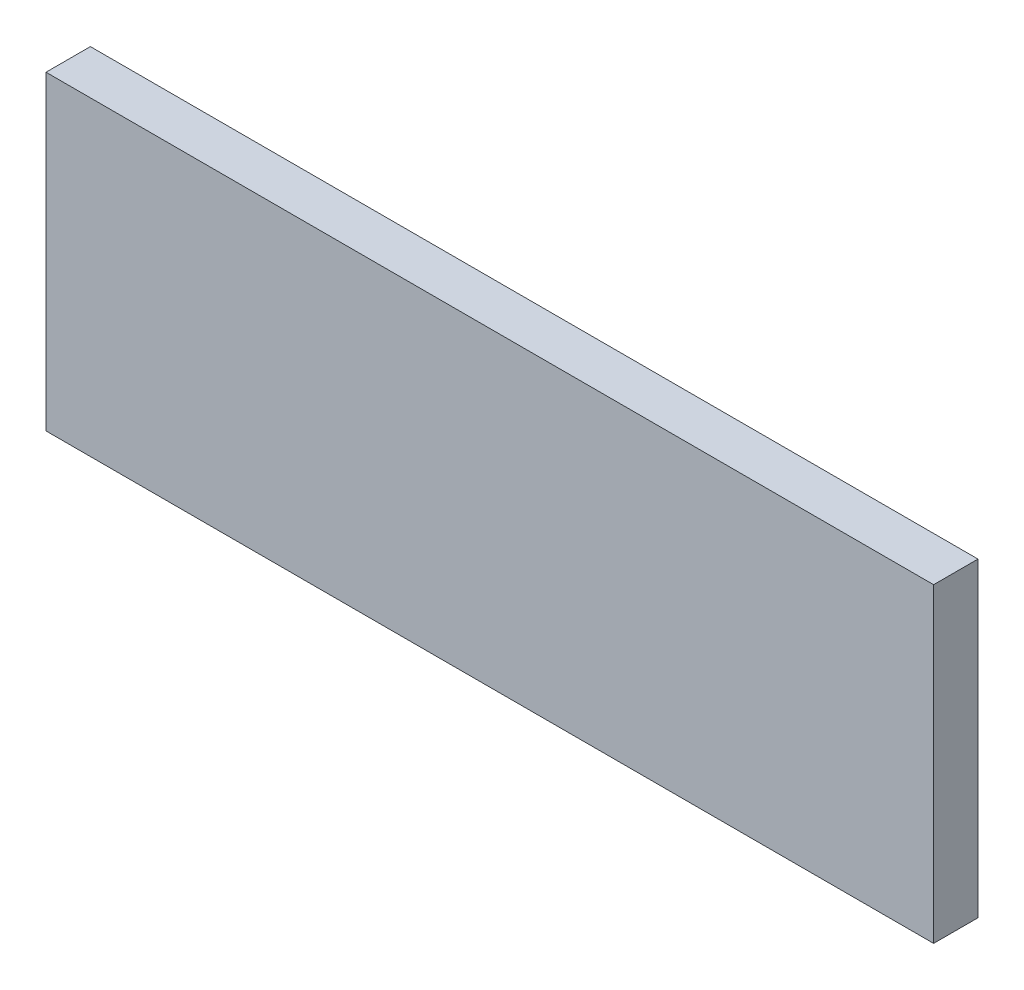
ISO-10303-21;
HEADER;
FILE_DESCRIPTION(('STEP AP214'),'2;1');
FILE_NAME('part.step','',(''),(''),'','','');
FILE_SCHEMA(('AUTOMOTIVE_DESIGN { 1 0 10303 214 1 1 1 1 }'));
ENDSEC;
DATA;
#1=APPLICATION_CONTEXT('core data for automotive mechanical design processes');
#2=APPLICATION_PROTOCOL_DEFINITION('international standard','automotive_design',2000,#1);
#3=PRODUCT_CONTEXT('',#1,'mechanical');
#4=PRODUCT('Part','Part','',(#3));
#5=PRODUCT_RELATED_PRODUCT_CATEGORY('part','',(#4));
#6=PRODUCT_DEFINITION_FORMATION('','',#4);
#7=PRODUCT_DEFINITION_CONTEXT('part definition',#1,'design');
#8=PRODUCT_DEFINITION('design','',#6,#7);
#9=PRODUCT_DEFINITION_SHAPE('','',#8);
#10=(LENGTH_UNIT() NAMED_UNIT(*) SI_UNIT(.MILLI.,.METRE.));
#11=(NAMED_UNIT(*) PLANE_ANGLE_UNIT() SI_UNIT($,.RADIAN.));
#12=(NAMED_UNIT(*) SI_UNIT($,.STERADIAN.) SOLID_ANGLE_UNIT());
#13=UNCERTAINTY_MEASURE_WITH_UNIT(LENGTH_MEASURE(1.E-05),#10,'distance_accuracy_value','');
#14=(GEOMETRIC_REPRESENTATION_CONTEXT(3) GLOBAL_UNCERTAINTY_ASSIGNED_CONTEXT((#13)) GLOBAL_UNIT_ASSIGNED_CONTEXT((#10,
#11,#12)) REPRESENTATION_CONTEXT('',''));
#15=CARTESIAN_POINT('',(0.,0.,0.));
#16=DIRECTION('',(0.,0.,1.));
#17=DIRECTION('',(1.,0.,0.));
#18=AXIS2_PLACEMENT_3D('',#15,#16,#17);
#19=CARTESIAN_POINT('',(-125.295302013423,74.2225503355704,12.7));
#20=DIRECTION('',(1.,0.,0.));
#21=DIRECTION('',(0.,0.,-1.));
#22=AXIS2_PLACEMENT_3D('',#19,#20,#21);
#23=PLANE('',#22);
#24=DIRECTION('',(0.,-1.,0.));
#25=VECTOR('',#24,1.);
#26=CARTESIAN_POINT('',(-125.295302013423,74.2225503355704,0.));
#27=LINE('',#26,#25);
#28=CARTESIAN_POINT('',(-125.295302013423,74.2225503355704,0.));
#29=VERTEX_POINT('',#28);
#30=CARTESIAN_POINT('',(-125.295302013423,-14.6774496644296,0.));
#31=VERTEX_POINT('',#30);
#32=EDGE_CURVE('E107',#29,#31,#27,.T.);
#33=ORIENTED_EDGE('',*,*,#32,.T.);
#34=DIRECTION('',(0.,0.,-1.));
#35=VECTOR('',#34,1.);
#36=CARTESIAN_POINT('',(-125.295302013423,-14.6774496644296,12.7));
#37=LINE('',#36,#35);
#38=CARTESIAN_POINT('',(-125.295302013423,-14.6774496644296,12.7));
#39=VERTEX_POINT('',#38);
#40=EDGE_CURVE('E11',#39,#31,#37,.T.);
#41=ORIENTED_EDGE('',*,*,#40,.F.);
#42=DIRECTION('',(0.,-1.,0.));
#43=VECTOR('',#42,1.);
#44=CARTESIAN_POINT('',(-125.295302013423,74.2225503355704,12.7));
#45=LINE('',#44,#43);
#46=CARTESIAN_POINT('',(-125.295302013423,74.2225503355704,12.7));
#47=VERTEX_POINT('',#46);
#48=EDGE_CURVE('E91',#47,#39,#45,.T.);
#49=ORIENTED_EDGE('',*,*,#48,.F.);
#50=DIRECTION('',(0.,0.,-1.));
#51=VECTOR('',#50,1.);
#52=CARTESIAN_POINT('',(-125.295302013423,74.2225503355704,12.7));
#53=LINE('',#52,#51);
#54=EDGE_CURVE('E103',#47,#29,#53,.T.);
#55=ORIENTED_EDGE('',*,*,#54,.T.);
#56=EDGE_LOOP('',(#33,#41,#49,#55));
#57=FACE_BOUND('',#56,.T.);
#58=ADVANCED_FACE('F39',(#57),#23,.F.);
#59=CARTESIAN_POINT('',(-125.295302013423,-14.6774496644296,12.7));
#60=DIRECTION('',(0.,1.,0.));
#61=DIRECTION('',(0.,0.,1.));
#62=AXIS2_PLACEMENT_3D('',#59,#60,#61);
#63=PLANE('',#62);
#64=DIRECTION('',(1.,0.,0.));
#65=VECTOR('',#64,1.);
#66=CARTESIAN_POINT('',(-125.295302013423,-14.6774496644296,0.));
#67=LINE('',#66,#65);
#68=CARTESIAN_POINT('',(128.704697986577,-14.6774496644296,0.));
#69=VERTEX_POINT('',#68);
#70=EDGE_CURVE('E96',#31,#69,#67,.T.);
#71=ORIENTED_EDGE('',*,*,#70,.T.);
#72=DIRECTION('',(0.,0.,-1.));
#73=VECTOR('',#72,1.);
#74=CARTESIAN_POINT('',(128.704697986577,-14.6774496644296,12.7));
#75=LINE('',#74,#73);
#76=CARTESIAN_POINT('',(128.704697986577,-14.6774496644296,12.7));
#77=VERTEX_POINT('',#76);
#78=EDGE_CURVE('E48',#77,#69,#75,.T.);
#79=ORIENTED_EDGE('',*,*,#78,.F.);
#80=DIRECTION('',(1.,0.,0.));
#81=VECTOR('',#80,1.);
#82=CARTESIAN_POINT('',(-125.295302013423,-14.6774496644296,12.7));
#83=LINE('',#82,#81);
#84=EDGE_CURVE('E86',#39,#77,#83,.T.);
#85=ORIENTED_EDGE('',*,*,#84,.F.);
#86=ORIENTED_EDGE('',*,*,#40,.T.);
#87=EDGE_LOOP('',(#71,#79,#85,#86));
#88=FACE_BOUND('',#87,.T.);
#89=ADVANCED_FACE('F95',(#88),#63,.F.);
#90=CARTESIAN_POINT('',(128.704697986577,74.2225503355704,12.7));
#91=DIRECTION('',(-1.,0.,0.));
#92=DIRECTION('',(0.,0.,1.));
#93=AXIS2_PLACEMENT_3D('',#90,#91,#92);
#94=PLANE('',#93);
#95=DIRECTION('',(0.,1.,0.));
#96=VECTOR('',#95,1.);
#97=CARTESIAN_POINT('',(128.704697986577,74.2225503355704,0.));
#98=LINE('',#97,#96);
#99=CARTESIAN_POINT('',(128.704697986577,74.2225503355704,0.));
#100=VERTEX_POINT('',#99);
#101=EDGE_CURVE('E73',#69,#100,#98,.T.);
#102=ORIENTED_EDGE('',*,*,#101,.T.);
#103=DIRECTION('',(0.,0.,-1.));
#104=VECTOR('',#103,1.);
#105=CARTESIAN_POINT('',(128.704697986577,74.2225503355704,12.7));
#106=LINE('',#105,#104);
#107=CARTESIAN_POINT('',(128.704697986577,74.2225503355704,12.7));
#108=VERTEX_POINT('',#107);
#109=EDGE_CURVE('E98',#108,#100,#106,.T.);
#110=ORIENTED_EDGE('',*,*,#109,.F.);
#111=DIRECTION('',(0.,1.,0.));
#112=VECTOR('',#111,1.);
#113=CARTESIAN_POINT('',(128.704697986577,74.2225503355704,12.7));
#114=LINE('',#113,#112);
#115=EDGE_CURVE('E89',#77,#108,#114,.T.);
#116=ORIENTED_EDGE('',*,*,#115,.F.);
#117=ORIENTED_EDGE('',*,*,#78,.T.);
#118=EDGE_LOOP('',(#102,#110,#116,#117));
#119=FACE_BOUND('',#118,.T.);
#120=ADVANCED_FACE('F99',(#119),#94,.F.);
#121=CARTESIAN_POINT('',(-125.295302013423,74.2225503355704,12.7));
#122=DIRECTION('',(0.,-1.,0.));
#123=DIRECTION('',(0.,0.,-1.));
#124=AXIS2_PLACEMENT_3D('',#121,#122,#123);
#125=PLANE('',#124);
#126=DIRECTION('',(-1.,0.,0.));
#127=VECTOR('',#126,1.);
#128=CARTESIAN_POINT('',(-125.295302013423,74.2225503355704,0.));
#129=LINE('',#128,#127);
#130=EDGE_CURVE('E79',#100,#29,#129,.T.);
#131=ORIENTED_EDGE('',*,*,#130,.T.);
#132=ORIENTED_EDGE('',*,*,#54,.F.);
#133=DIRECTION('',(-1.,0.,0.));
#134=VECTOR('',#133,1.);
#135=CARTESIAN_POINT('',(-125.295302013423,74.2225503355704,12.7));
#136=LINE('',#135,#134);
#137=EDGE_CURVE('E56',#108,#47,#136,.T.);
#138=ORIENTED_EDGE('',*,*,#137,.F.);
#139=ORIENTED_EDGE('',*,*,#109,.T.);
#140=EDGE_LOOP('',(#131,#132,#138,#139));
#141=FACE_BOUND('',#140,.T.);
#142=ADVANCED_FACE('F120',(#141),#125,.F.);
#143=CARTESIAN_POINT('',(0.,0.,12.7));
#144=DIRECTION('',(0.,0.,1.));
#145=DIRECTION('',(1.,0.,0.));
#146=AXIS2_PLACEMENT_3D('',#143,#144,#145);
#147=PLANE('',#146);
#148=ORIENTED_EDGE('',*,*,#48,.T.);
#149=ORIENTED_EDGE('',*,*,#84,.T.);
#150=ORIENTED_EDGE('',*,*,#115,.T.);
#151=ORIENTED_EDGE('',*,*,#137,.T.);
#152=EDGE_LOOP('',(#148,#149,#150,#151));
#153=FACE_BOUND('',#152,.T.);
#154=ADVANCED_FACE('F87',(#153),#147,.T.);
#155=CARTESIAN_POINT('',(0.,0.,0.));
#156=DIRECTION('',(0.,0.,1.));
#157=DIRECTION('',(1.,0.,0.));
#158=AXIS2_PLACEMENT_3D('',#155,#156,#157);
#159=PLANE('',#158);
#160=ORIENTED_EDGE('',*,*,#32,.F.);
#161=ORIENTED_EDGE('',*,*,#130,.F.);
#162=ORIENTED_EDGE('',*,*,#101,.F.);
#163=ORIENTED_EDGE('',*,*,#70,.F.);
#164=EDGE_LOOP('',(#160,#161,#162,#163));
#165=FACE_BOUND('',#164,.T.);
#166=ADVANCED_FACE('F123',(#165),#159,.F.);
#167=CLOSED_SHELL('',(#58,#89,#120,#142,#154,#166));
#168=MANIFOLD_SOLID_BREP('B2',#167);
#169=ADVANCED_BREP_SHAPE_REPRESENTATION('',(#18,#168),#14);
#170=SHAPE_DEFINITION_REPRESENTATION(#9,#169);
ENDSEC;
END-ISO-10303-21;
